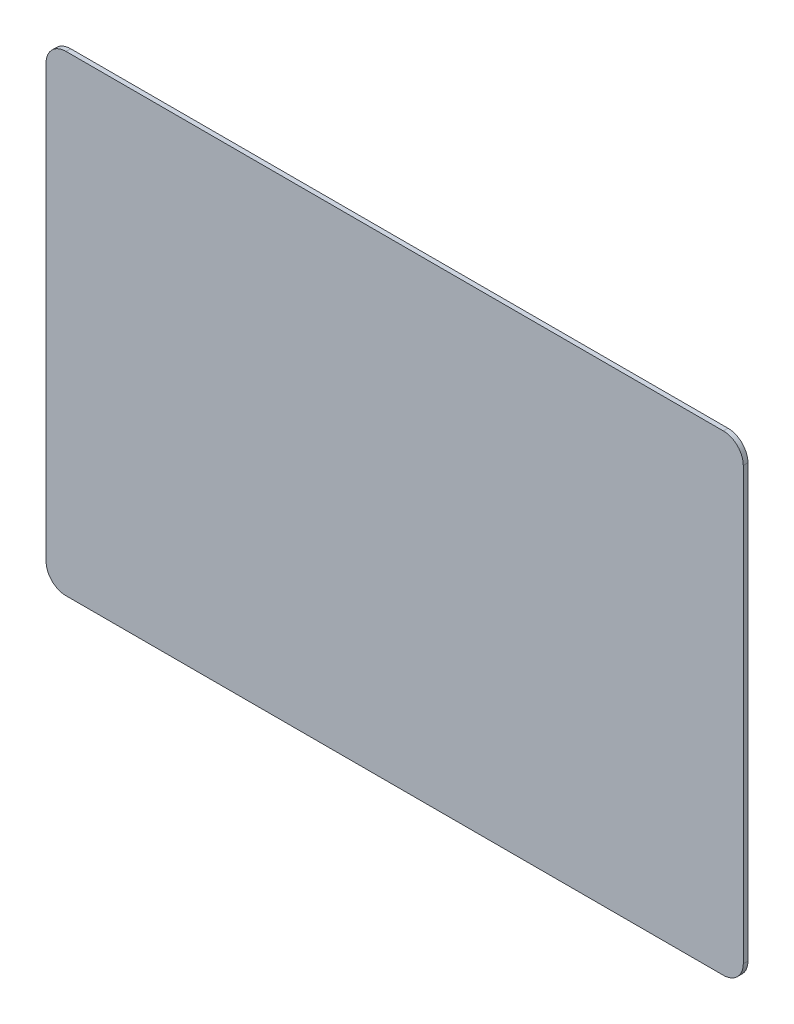
ISO-10303-21;
HEADER;
FILE_DESCRIPTION(('STEP AP214'),'2;1');
FILE_NAME('part.step','',(''),(''),'','','');
FILE_SCHEMA(('AUTOMOTIVE_DESIGN { 1 0 10303 214 1 1 1 1 }'));
ENDSEC;
DATA;
#1=APPLICATION_CONTEXT('core data for automotive mechanical design processes');
#2=APPLICATION_PROTOCOL_DEFINITION('international standard','automotive_design',2000,#1);
#3=PRODUCT_CONTEXT('',#1,'mechanical');
#4=PRODUCT('Part','Part','',(#3));
#5=PRODUCT_RELATED_PRODUCT_CATEGORY('part','',(#4));
#6=PRODUCT_DEFINITION_FORMATION('','',#4);
#7=PRODUCT_DEFINITION_CONTEXT('part definition',#1,'design');
#8=PRODUCT_DEFINITION('design','',#6,#7);
#9=PRODUCT_DEFINITION_SHAPE('','',#8);
#10=(LENGTH_UNIT() NAMED_UNIT(*) SI_UNIT(.MILLI.,.METRE.));
#11=(NAMED_UNIT(*) PLANE_ANGLE_UNIT() SI_UNIT($,.RADIAN.));
#12=(NAMED_UNIT(*) SI_UNIT($,.STERADIAN.) SOLID_ANGLE_UNIT());
#13=UNCERTAINTY_MEASURE_WITH_UNIT(LENGTH_MEASURE(1.E-05),#10,'distance_accuracy_value','');
#14=(GEOMETRIC_REPRESENTATION_CONTEXT(3) GLOBAL_UNCERTAINTY_ASSIGNED_CONTEXT((#13)) GLOBAL_UNIT_ASSIGNED_CONTEXT((#10,
#11,#12)) REPRESENTATION_CONTEXT('',''));
#15=CARTESIAN_POINT('',(0.,0.,0.));
#16=DIRECTION('',(0.,0.,1.));
#17=DIRECTION('',(1.,0.,0.));
#18=AXIS2_PLACEMENT_3D('',#15,#16,#17);
#19=CARTESIAN_POINT('',(49.5,-272.091788976976,0.701000000000714));
#20=DIRECTION('',(0.,0.,-1.));
#21=DIRECTION('',(-1.,0.,0.));
#22=AXIS2_PLACEMENT_3D('',#19,#20,#21);
#23=CYLINDRICAL_SURFACE('',#22,2.99999999999999);
#24=CARTESIAN_POINT('',(49.5,-275.091788976976,0.70000000000033));
#25=CARTESIAN_POINT('',(49.5843798635019,-275.0917970621,0.70000000000033));
#26=CARTESIAN_POINT('',(49.668755894761,-275.088229025354,0.70000000000033));
#27=CARTESIAN_POINT('',(49.8369042606306,-275.074003276228,0.700000000000331));
#28=CARTESIAN_POINT('',(49.9206766240054,-275.063345903938,0.700000000000331));
#29=CARTESIAN_POINT('',(50.0869669809482,-275.035014748458,0.700000000000331));
#30=CARTESIAN_POINT('',(50.1694858745097,-275.017346273078,0.700000000000332));
#31=CARTESIAN_POINT('',(50.3327218152186,-274.975136229641,0.700000000000332));
#32=CARTESIAN_POINT('',(50.4134388843482,-274.950594745483,0.700000000000332));
#33=CARTESIAN_POINT('',(50.6521085428877,-274.866859032351,0.700000000000333));
#34=CARTESIAN_POINT('',(50.8066472549077,-274.797541951899,0.700000000000333));
#35=CARTESIAN_POINT('',(51.1017802103869,-274.633992715414,0.700000000000334));
#36=CARTESIAN_POINT('',(51.242376904348,-274.53976494849,0.700000000000335));
#37=CARTESIAN_POINT('',(51.5057786852385,-274.32903761871,0.700000000000336));
#38=CARTESIAN_POINT('',(51.6285839457793,-274.212538273208,0.700000000000336));
#39=CARTESIAN_POINT('',(51.8529112926632,-273.960550982874,0.700000000000337));
#40=CARTESIAN_POINT('',(51.9544292107432,-273.825059327819,0.700000000000337));
#41=CARTESIAN_POINT('',(52.1332922306062,-273.538941638879,0.700000000000337));
#42=CARTESIAN_POINT('',(52.2106325999279,-273.38831264966,0.700000000000338));
#43=CARTESIAN_POINT('',(52.338886608652,-273.076238034081,0.700000000000338));
#44=CARTESIAN_POINT('',(52.3898157261376,-272.914798805749,0.700000000000338));
#45=CARTESIAN_POINT('',(52.4511453910628,-272.642274531183,0.700000000000338));
#46=CARTESIAN_POINT('',(52.4694548018945,-272.532903868641,0.700000000000339));
#47=CARTESIAN_POINT('',(52.493880504202,-272.312967077816,0.700000000000339));
#48=CARTESIAN_POINT('',(52.500014081586,-272.202402868695,0.700000000000339));
#49=CARTESIAN_POINT('',(52.4999999999999,-272.091788976976,0.700000000000339));
#50=B_SPLINE_CURVE_WITH_KNOTS('',3,(#24,#25,#26,#27,#28,#29,#30,#31,#32,#33,#34,#35,#36,#37,#38,
#39,#40,#41,#42,#43,#44,#45,#46,#47,#48,#49),.UNSPECIFIED.,.F.,.F.,(4,2,2,2,2,2,2,2,2,2,2,2,4),
(0.,0.253057267660258,0.506102396572864,0.758956320118635,1.01180715716301,1.51730545512211,
2.0227147467139,2.52811910611892,3.03362233625821,3.53922445064271,4.04452992552588,
4.37657668424449,4.70815170142137),.UNSPECIFIED.);
#51=CARTESIAN_POINT('',(49.5,-275.091788976976,0.70000000000033));
#52=VERTEX_POINT('',#51);
#53=CARTESIAN_POINT('',(52.5,-272.091788976976,0.699997500000526));
#54=VERTEX_POINT('',#53);
#55=EDGE_CURVE('E184',#52,#54,#50,.T.);
#56=ORIENTED_EDGE('',*,*,#55,.F.);
#57=DIRECTION('',(0.,0.,-1.));
#58=VECTOR('',#57,1.);
#59=CARTESIAN_POINT('',(49.5,-275.091788976976,0.701000000000714));
#60=LINE('',#59,#58);
#61=CARTESIAN_POINT('',(49.5,-275.091788976976,0.));
#62=VERTEX_POINT('',#61);
#63=EDGE_CURVE('E45',#52,#62,#60,.T.);
#64=ORIENTED_EDGE('',*,*,#63,.T.);
#65=CARTESIAN_POINT('',(49.5,-272.091788976976,0.));
#66=DIRECTION('',(0.,0.,1.));
#67=DIRECTION('',(1.,0.,0.));
#68=AXIS2_PLACEMENT_3D('',#65,#66,#67);
#69=CIRCLE('',#68,2.99999999999999);
#70=CARTESIAN_POINT('',(52.5,-272.091788976976,0.));
#71=VERTEX_POINT('',#70);
#72=EDGE_CURVE('E221',#62,#71,#69,.T.);
#73=ORIENTED_EDGE('',*,*,#72,.T.);
#74=DIRECTION('',(0.,0.,-1.));
#75=VECTOR('',#74,1.);
#76=CARTESIAN_POINT('',(52.5,-272.091788976976,0.701000000000714));
#77=LINE('',#76,#75);
#78=EDGE_CURVE('E96',#54,#71,#77,.T.);
#79=ORIENTED_EDGE('',*,*,#78,.F.);
#80=EDGE_LOOP('',(#56,#64,#73,#79));
#81=FACE_BOUND('',#80,.T.);
#82=ADVANCED_FACE('F38',(#81),#23,.T.);
#83=CARTESIAN_POINT('',(52.5,-272.091788976976,0.701000000000714));
#84=DIRECTION('',(-1.,0.,0.));
#85=DIRECTION('',(0.,-1.,0.));
#86=AXIS2_PLACEMENT_3D('',#83,#84,#85);
#87=PLANE('',#86);
#88=CARTESIAN_POINT('',(52.5,-272.091788976976,0.700000000000339));
#89=CARTESIAN_POINT('',(52.4999999999999,-264.295802660997,0.70000000000034));
#90=CARTESIAN_POINT('',(52.4999999999999,-256.499816345018,0.700000000000342));
#91=CARTESIAN_POINT('',(52.4999999999999,-234.833149678351,0.700000000000346));
#92=CARTESIAN_POINT('',(52.5,-220.962469327664,0.700000000000347));
#93=CARTESIAN_POINT('',(52.5,-207.091788976976,0.700000000000349));
#94=B_SPLINE_CURVE_WITH_KNOTS('',3,(#88,#89,#90,#91,#92,#93),.UNSPECIFIED.,.F.,.F.,(4,2,4),(0.,
23.3879589479382,64.9999999999999),.UNSPECIFIED.);
#95=CARTESIAN_POINT('',(52.5,-207.091788976976,0.700000000000349));
#96=VERTEX_POINT('',#95);
#97=EDGE_CURVE('E103',#54,#96,#94,.T.);
#98=ORIENTED_EDGE('',*,*,#97,.F.);
#99=ORIENTED_EDGE('',*,*,#78,.T.);
#100=DIRECTION('',(0.,1.,0.));
#101=VECTOR('',#100,1.);
#102=CARTESIAN_POINT('',(52.5,-272.091788976976,0.));
#103=LINE('',#102,#101);
#104=CARTESIAN_POINT('',(52.5,-207.091788976976,0.));
#105=VERTEX_POINT('',#104);
#106=EDGE_CURVE('E223',#71,#105,#103,.T.);
#107=ORIENTED_EDGE('',*,*,#106,.T.);
#108=DIRECTION('',(0.,0.,-1.));
#109=VECTOR('',#108,1.);
#110=CARTESIAN_POINT('',(52.5,-207.091788976976,0.701000000000714));
#111=LINE('',#110,#109);
#112=EDGE_CURVE('E226',#96,#105,#111,.T.);
#113=ORIENTED_EDGE('',*,*,#112,.F.);
#114=EDGE_LOOP('',(#98,#99,#107,#113));
#115=FACE_BOUND('',#114,.T.);
#116=ADVANCED_FACE('F190',(#115),#87,.F.);
#117=CARTESIAN_POINT('',(49.5,-207.091788976976,0.701000000000714));
#118=DIRECTION('',(0.,0.,-1.));
#119=DIRECTION('',(-1.,0.,0.));
#120=AXIS2_PLACEMENT_3D('',#117,#118,#119);
#121=CYLINDRICAL_SURFACE('',#120,3.);
#122=CARTESIAN_POINT('',(52.5,-207.091788976976,0.700000000000349));
#123=CARTESIAN_POINT('',(52.5000080851237,-207.007409113474,0.700000000000349));
#124=CARTESIAN_POINT('',(52.4964400483774,-206.923033082215,0.700000000000349));
#125=CARTESIAN_POINT('',(52.482214299252,-206.754884716346,0.700000000000349));
#126=CARTESIAN_POINT('',(52.4715569269616,-206.671112352971,0.700000000000349));
#127=CARTESIAN_POINT('',(52.443225771482,-206.504821996028,0.700000000000349));
#128=CARTESIAN_POINT('',(52.4255572961018,-206.422303102467,0.700000000000349));
#129=CARTESIAN_POINT('',(52.3833472526641,-206.259067161758,0.700000000000349));
#130=CARTESIAN_POINT('',(52.3588057685067,-206.178350092628,0.700000000000349));
#131=CARTESIAN_POINT('',(52.2750700553752,-205.939680434089,0.700000000000349));
#132=CARTESIAN_POINT('',(52.2057529749222,-205.785141722069,0.700000000000348));
#133=CARTESIAN_POINT('',(52.0422037384376,-205.49000876659,0.700000000000348));
#134=CARTESIAN_POINT('',(51.9479759715141,-205.349412072628,0.700000000000348));
#135=CARTESIAN_POINT('',(51.7372486417336,-205.086010291738,0.700000000000348));
#136=CARTESIAN_POINT('',(51.6207492962314,-204.963205031197,0.700000000000348));
#137=CARTESIAN_POINT('',(51.368762005898,-204.738877684313,0.700000000000347));
#138=CARTESIAN_POINT('',(51.2332703508427,-204.637359766233,0.700000000000347));
#139=CARTESIAN_POINT('',(50.9471526619026,-204.45849674637,0.700000000000347));
#140=CARTESIAN_POINT('',(50.7965236726841,-204.381156377049,0.700000000000347));
#141=CARTESIAN_POINT('',(50.4844490571044,-204.252902368324,0.700000000000347));
#142=CARTESIAN_POINT('',(50.3230098287728,-204.201973250839,0.700000000000346));
#143=CARTESIAN_POINT('',(50.0504855542061,-204.140643585914,0.700000000000346));
#144=CARTESIAN_POINT('',(49.9411148916651,-204.122334175082,0.700000000000346));
#145=CARTESIAN_POINT('',(49.7211781008399,-204.097908472774,0.700000000000346));
#146=CARTESIAN_POINT('',(49.6106138917187,-204.09177489539,0.700000000000346));
#147=CARTESIAN_POINT('',(49.4999999999999,-204.091788976976,0.700000000000346));
#148=B_SPLINE_CURVE_WITH_KNOTS('',3,(#122,#123,#124,#125,#126,#127,#128,#129,#130,#131,#132,
#133,#134,#135,#136,#137,#138,#139,#140,#141,#142,#143,#144,#145,#146,#147),.UNSPECIFIED.,.F.,
.F.,(4,2,2,2,2,2,2,2,2,2,2,2,4),(0.,0.253057267660222,0.506102396572833,0.758956320118641,
1.01180715716298,1.51730545512208,2.02271474671388,2.52811910611888,3.03362233625813,
3.53922445064267,4.04452992552591,4.37657668424453,4.70815170142148),.UNSPECIFIED.);
#149=CARTESIAN_POINT('',(49.5,-204.091788976976,0.699997500000395));
#150=VERTEX_POINT('',#149);
#151=EDGE_CURVE('E172',#96,#150,#148,.T.);
#152=ORIENTED_EDGE('',*,*,#151,.F.);
#153=ORIENTED_EDGE('',*,*,#112,.T.);
#154=CARTESIAN_POINT('',(49.5,-207.091788976976,0.));
#155=DIRECTION('',(0.,0.,1.));
#156=DIRECTION('',(1.,0.,0.));
#157=AXIS2_PLACEMENT_3D('',#154,#155,#156);
#158=CIRCLE('',#157,3.);
#159=CARTESIAN_POINT('',(49.5,-204.091788976976,0.));
#160=VERTEX_POINT('',#159);
#161=EDGE_CURVE('E227',#105,#160,#158,.T.);
#162=ORIENTED_EDGE('',*,*,#161,.T.);
#163=DIRECTION('',(0.,0.,-1.));
#164=VECTOR('',#163,1.);
#165=CARTESIAN_POINT('',(49.5,-204.091788976976,0.701000000000714));
#166=LINE('',#165,#164);
#167=EDGE_CURVE('E230',#150,#160,#166,.T.);
#168=ORIENTED_EDGE('',*,*,#167,.F.);
#169=EDGE_LOOP('',(#152,#153,#162,#168));
#170=FACE_BOUND('',#169,.T.);
#171=ADVANCED_FACE('F163',(#170),#121,.T.);
#172=CARTESIAN_POINT('',(49.5,-204.091788976976,0.701000000000714));
#173=DIRECTION('',(0.,-1.,0.));
#174=DIRECTION('',(1.,0.,0.));
#175=AXIS2_PLACEMENT_3D('',#172,#173,#174);
#176=PLANE('',#175);
#177=CARTESIAN_POINT('',(49.5,-204.091788976976,0.700000000000346));
#178=CARTESIAN_POINT('',(16.5,-204.091788976976,0.700000000000256));
#179=CARTESIAN_POINT('',(-16.5,-204.091788976976,0.700000000000166));
#180=CARTESIAN_POINT('',(-49.5,-204.091788976976,0.700000000000076));
#181=B_SPLINE_CURVE_WITH_KNOTS('',3,(#177,#178,#179,#180),.UNSPECIFIED.,.F.,.F.,(4,4),(0.,
98.9999999999999),.UNSPECIFIED.);
#182=CARTESIAN_POINT('',(-49.5,-204.091788976976,0.700000000000076));
#183=VERTEX_POINT('',#182);
#184=EDGE_CURVE('E131',#150,#183,#181,.T.);
#185=ORIENTED_EDGE('',*,*,#184,.F.);
#186=ORIENTED_EDGE('',*,*,#167,.T.);
#187=DIRECTION('',(-1.,0.,0.));
#188=VECTOR('',#187,1.);
#189=CARTESIAN_POINT('',(49.5,-204.091788976976,0.));
#190=LINE('',#189,#188);
#191=CARTESIAN_POINT('',(-49.5,-204.091788976976,0.));
#192=VERTEX_POINT('',#191);
#193=EDGE_CURVE('E231',#160,#192,#190,.T.);
#194=ORIENTED_EDGE('',*,*,#193,.T.);
#195=DIRECTION('',(0.,0.,-1.));
#196=VECTOR('',#195,1.);
#197=CARTESIAN_POINT('',(-49.5,-204.091788976976,0.701000000000714));
#198=LINE('',#197,#196);
#199=EDGE_CURVE('E234',#183,#192,#198,.T.);
#200=ORIENTED_EDGE('',*,*,#199,.F.);
#201=EDGE_LOOP('',(#185,#186,#194,#200));
#202=FACE_BOUND('',#201,.T.);
#203=ADVANCED_FACE('F158',(#202),#176,.F.);
#204=CARTESIAN_POINT('',(-49.5,-207.091788976976,0.701000000000714));
#205=DIRECTION('',(0.,0.,-1.));
#206=DIRECTION('',(-1.,0.,0.));
#207=AXIS2_PLACEMENT_3D('',#204,#205,#206);
#208=CYLINDRICAL_SURFACE('',#207,3.);
#209=CARTESIAN_POINT('',(-49.5,-204.091788976976,0.700000000000076));
#210=CARTESIAN_POINT('',(-49.584379863502,-204.091780891853,0.700000000000076));
#211=CARTESIAN_POINT('',(-49.6687558947611,-204.095348928599,0.700000000000076));
#212=CARTESIAN_POINT('',(-49.8369042606307,-204.109574677724,0.700000000000075));
#213=CARTESIAN_POINT('',(-49.9206766240055,-204.120232050015,0.700000000000075));
#214=CARTESIAN_POINT('',(-50.0869669809483,-204.148563205494,0.700000000000074));
#215=CARTESIAN_POINT('',(-50.1694858745098,-204.166231680875,0.700000000000074));
#216=CARTESIAN_POINT('',(-50.3327218152187,-204.208441724312,0.700000000000073));
#217=CARTESIAN_POINT('',(-50.4134388843483,-204.23298320847,0.700000000000073));
#218=CARTESIAN_POINT('',(-50.6521085428878,-204.316718921601,0.700000000000072));
#219=CARTESIAN_POINT('',(-50.8066472549078,-204.386036002054,0.700000000000072));
#220=CARTESIAN_POINT('',(-51.1017802103869,-204.549585238539,0.700000000000071));
#221=CARTESIAN_POINT('',(-51.2423769043481,-204.643813005462,0.70000000000007));
#222=CARTESIAN_POINT('',(-51.5057786852387,-204.854540335243,0.70000000000007));
#223=CARTESIAN_POINT('',(-51.6285839457794,-204.971039680745,0.700000000000069));
#224=CARTESIAN_POINT('',(-51.8529112926632,-205.223026971078,0.700000000000069));
#225=CARTESIAN_POINT('',(-51.9544292107433,-205.358518626134,0.700000000000069));
#226=CARTESIAN_POINT('',(-52.1332922306062,-205.644636315074,0.700000000000068));
#227=CARTESIAN_POINT('',(-52.210632599928,-205.795265304292,0.700000000000068));
#228=CARTESIAN_POINT('',(-52.338886608652,-206.107339919872,0.700000000000068));
#229=CARTESIAN_POINT('',(-52.3898157261376,-206.268779148204,0.700000000000068));
#230=CARTESIAN_POINT('',(-52.4511453910628,-206.54130342277,0.700000000000068));
#231=CARTESIAN_POINT('',(-52.4694548018946,-206.650674085311,0.700000000000068));
#232=CARTESIAN_POINT('',(-52.4938805042021,-206.870610876137,0.700000000000068));
#233=CARTESIAN_POINT('',(-52.5000140815861,-206.981175085258,0.700000000000068));
#234=CARTESIAN_POINT('',(-52.5,-207.091788976976,0.700000000000068));
#235=B_SPLINE_CURVE_WITH_KNOTS('',3,(#209,#210,#211,#212,#213,#214,#215,#216,#217,#218,#219,
#220,#221,#222,#223,#224,#225,#226,#227,#228,#229,#230,#231,#232,#233,#234),.UNSPECIFIED.,.F.,
.F.,(4,2,2,2,2,2,2,2,2,2,2,2,4),(0.,0.253057267660284,0.506102396572889,0.758956320118698,
1.01180715716307,1.51730545512215,2.02271474671397,2.528119106119,3.03362233625832,
3.53922445064281,4.04452992552598,4.37657668424457,4.70815170142148),.UNSPECIFIED.);
#236=CARTESIAN_POINT('',(-52.5,-207.091788976976,0.699997500000391));
#237=VERTEX_POINT('',#236);
#238=EDGE_CURVE('E129',#183,#237,#235,.T.);
#239=ORIENTED_EDGE('',*,*,#238,.F.);
#240=ORIENTED_EDGE('',*,*,#199,.T.);
#241=CARTESIAN_POINT('',(-49.5,-207.091788976976,0.));
#242=DIRECTION('',(0.,0.,1.));
#243=DIRECTION('',(1.,0.,0.));
#244=AXIS2_PLACEMENT_3D('',#241,#242,#243);
#245=CIRCLE('',#244,3.);
#246=CARTESIAN_POINT('',(-52.5,-207.091788976976,0.));
#247=VERTEX_POINT('',#246);
#248=EDGE_CURVE('E235',#192,#247,#245,.T.);
#249=ORIENTED_EDGE('',*,*,#248,.T.);
#250=DIRECTION('',(0.,0.,-1.));
#251=VECTOR('',#250,1.);
#252=CARTESIAN_POINT('',(-52.5,-207.091788976976,0.701000000000714));
#253=LINE('',#252,#251);
#254=EDGE_CURVE('E238',#237,#247,#253,.T.);
#255=ORIENTED_EDGE('',*,*,#254,.F.);
#256=EDGE_LOOP('',(#239,#240,#249,#255));
#257=FACE_BOUND('',#256,.T.);
#258=ADVANCED_FACE('F152',(#257),#208,.T.);
#259=CARTESIAN_POINT('',(-52.5,-207.091788976976,0.701000000000714));
#260=DIRECTION('',(1.,0.,0.));
#261=DIRECTION('',(0.,1.,0.));
#262=AXIS2_PLACEMENT_3D('',#259,#260,#261);
#263=PLANE('',#262);
#264=CARTESIAN_POINT('',(-52.5,-207.091788976976,0.700000000000068));
#265=CARTESIAN_POINT('',(-52.5,-214.887775292956,0.700000000000076));
#266=CARTESIAN_POINT('',(-52.5,-222.683761608935,0.700000000000083));
#267=CARTESIAN_POINT('',(-52.5,-244.350428275602,0.700000000000103));
#268=CARTESIAN_POINT('',(-52.5,-258.221108626289,0.700000000000114));
#269=CARTESIAN_POINT('',(-52.5,-272.091788976976,0.700000000000124));
#270=B_SPLINE_CURVE_WITH_KNOTS('',3,(#264,#265,#266,#267,#268,#269),.UNSPECIFIED.,.F.,.F.,(4,2,
4),(0.,23.3879589479382,65.),.UNSPECIFIED.);
#271=CARTESIAN_POINT('',(-52.5,-272.091788976976,0.700000000000124));
#272=VERTEX_POINT('',#271);
#273=EDGE_CURVE('E50',#237,#272,#270,.T.);
#274=ORIENTED_EDGE('',*,*,#273,.F.);
#275=ORIENTED_EDGE('',*,*,#254,.T.);
#276=DIRECTION('',(0.,-1.,0.));
#277=VECTOR('',#276,1.);
#278=CARTESIAN_POINT('',(-52.5,-207.091788976976,0.));
#279=LINE('',#278,#277);
#280=CARTESIAN_POINT('',(-52.5,-272.091788976976,0.));
#281=VERTEX_POINT('',#280);
#282=EDGE_CURVE('E123',#247,#281,#279,.T.);
#283=ORIENTED_EDGE('',*,*,#282,.T.);
#284=DIRECTION('',(0.,0.,-1.));
#285=VECTOR('',#284,1.);
#286=CARTESIAN_POINT('',(-52.5,-272.091788976976,0.701000000000714));
#287=LINE('',#286,#285);
#288=EDGE_CURVE('E114',#272,#281,#287,.T.);
#289=ORIENTED_EDGE('',*,*,#288,.F.);
#290=EDGE_LOOP('',(#274,#275,#283,#289));
#291=FACE_BOUND('',#290,.T.);
#292=ADVANCED_FACE('F120',(#291),#263,.F.);
#293=CARTESIAN_POINT('',(-49.5,-272.091788976976,0.701000000000714));
#294=DIRECTION('',(0.,0.,-1.));
#295=DIRECTION('',(-1.,0.,0.));
#296=AXIS2_PLACEMENT_3D('',#293,#294,#295);
#297=CYLINDRICAL_SURFACE('',#296,3.);
#298=CARTESIAN_POINT('',(-52.5,-272.091788976976,0.700000000000124));
#299=CARTESIAN_POINT('',(-52.5000080851238,-272.176168840478,0.700000000000125));
#300=CARTESIAN_POINT('',(-52.4964400483774,-272.260544871737,0.700000000000125));
#301=CARTESIAN_POINT('',(-52.482214299252,-272.428693237607,0.700000000000125));
#302=CARTESIAN_POINT('',(-52.4715569269616,-272.512465600982,0.700000000000125));
#303=CARTESIAN_POINT('',(-52.443225771482,-272.678755957925,0.700000000000125));
#304=CARTESIAN_POINT('',(-52.4255572961018,-272.761274851486,0.700000000000125));
#305=CARTESIAN_POINT('',(-52.3833472526641,-272.924510792195,0.700000000000125));
#306=CARTESIAN_POINT('',(-52.3588057685066,-273.005227861325,0.700000000000125));
#307=CARTESIAN_POINT('',(-52.2750700553751,-273.243897519864,0.700000000000126));
#308=CARTESIAN_POINT('',(-52.2057529749221,-273.398436231884,0.700000000000126));
#309=CARTESIAN_POINT('',(-52.0422037384375,-273.693569187363,0.700000000000126));
#310=CARTESIAN_POINT('',(-51.947975971514,-273.834165881325,0.700000000000127));
#311=CARTESIAN_POINT('',(-51.7372486417334,-274.097567662215,0.700000000000127));
#312=CARTESIAN_POINT('',(-51.6207492962312,-274.220372922756,0.700000000000127));
#313=CARTESIAN_POINT('',(-51.3687620058978,-274.44470026964,0.700000000000128));
#314=CARTESIAN_POINT('',(-51.2332703508425,-274.54621818772,0.700000000000128));
#315=CARTESIAN_POINT('',(-50.9471526619024,-274.725081207583,0.700000000000128));
#316=CARTESIAN_POINT('',(-50.7965236726839,-274.802421576904,0.700000000000129));
#317=CARTESIAN_POINT('',(-50.4844490571041,-274.930675585628,0.700000000000129));
#318=CARTESIAN_POINT('',(-50.3230098287726,-274.981604703114,0.700000000000129));
#319=CARTESIAN_POINT('',(-50.0504855542059,-275.042934368039,0.70000000000013));
#320=CARTESIAN_POINT('',(-49.941114891665,-275.061243778871,0.70000000000013));
#321=CARTESIAN_POINT('',(-49.7211781008399,-275.085669481178,0.70000000000013));
#322=CARTESIAN_POINT('',(-49.6106138917187,-275.091803058563,0.70000000000013));
#323=CARTESIAN_POINT('',(-49.5,-275.091788976976,0.700000000000131));
#324=B_SPLINE_CURVE_WITH_KNOTS('',3,(#298,#299,#300,#301,#302,#303,#304,#305,#306,#307,#308,
#309,#310,#311,#312,#313,#314,#315,#316,#317,#318,#319,#320,#321,#322,#323),.UNSPECIFIED.,.F.,
.F.,(4,2,2,2,2,2,2,2,2,2,2,2,4),(0.,0.253057267660278,0.506102396572891,0.758956320118759,
1.01180715716314,1.51730545512224,2.02271474671415,2.52811910611912,3.03362233625837,
3.5392244506429,4.04452992552612,4.37657668424462,4.70815170142145),.UNSPECIFIED.);
#325=CARTESIAN_POINT('',(-49.5,-275.091788976976,0.699997500000422));
#326=VERTEX_POINT('',#325);
#327=EDGE_CURVE('E11',#272,#326,#324,.T.);
#328=ORIENTED_EDGE('',*,*,#327,.F.);
#329=ORIENTED_EDGE('',*,*,#288,.T.);
#330=CARTESIAN_POINT('',(-49.5,-272.091788976976,0.));
#331=DIRECTION('',(0.,0.,1.));
#332=DIRECTION('',(1.,0.,0.));
#333=AXIS2_PLACEMENT_3D('',#330,#331,#332);
#334=CIRCLE('',#333,3.);
#335=CARTESIAN_POINT('',(-49.5,-275.091788976976,0.));
#336=VERTEX_POINT('',#335);
#337=EDGE_CURVE('E125',#281,#336,#334,.T.);
#338=ORIENTED_EDGE('',*,*,#337,.T.);
#339=DIRECTION('',(0.,0.,-1.));
#340=VECTOR('',#339,1.);
#341=CARTESIAN_POINT('',(-49.5,-275.091788976976,0.701000000000714));
#342=LINE('',#341,#340);
#343=EDGE_CURVE('E63',#326,#336,#342,.T.);
#344=ORIENTED_EDGE('',*,*,#343,.F.);
#345=EDGE_LOOP('',(#328,#329,#338,#344));
#346=FACE_BOUND('',#345,.T.);
#347=ADVANCED_FACE('F113',(#346),#297,.T.);
#348=CARTESIAN_POINT('',(-49.5,-275.091788976976,0.701000000000714));
#349=DIRECTION('',(0.,1.,0.));
#350=DIRECTION('',(0.,0.,1.));
#351=AXIS2_PLACEMENT_3D('',#348,#349,#350);
#352=PLANE('',#351);
#353=CARTESIAN_POINT('',(-49.5,-275.091788976976,0.700000000000131));
#354=CARTESIAN_POINT('',(-16.5,-275.091788976976,0.700000000000197));
#355=CARTESIAN_POINT('',(16.5,-275.091788976976,0.700000000000263));
#356=CARTESIAN_POINT('',(49.4999999999999,-275.091788976976,0.70000000000033));
#357=B_SPLINE_CURVE_WITH_KNOTS('',3,(#353,#354,#355,#356),.UNSPECIFIED.,.F.,.F.,(4,4),(0.,
98.9999999999999),.UNSPECIFIED.);
#358=EDGE_CURVE('E200',#326,#52,#357,.T.);
#359=ORIENTED_EDGE('',*,*,#358,.F.);
#360=ORIENTED_EDGE('',*,*,#343,.T.);
#361=DIRECTION('',(1.,0.,0.));
#362=VECTOR('',#361,1.);
#363=CARTESIAN_POINT('',(-49.5,-275.091788976976,0.));
#364=LINE('',#363,#362);
#365=EDGE_CURVE('E201',#336,#62,#364,.T.);
#366=ORIENTED_EDGE('',*,*,#365,.T.);
#367=ORIENTED_EDGE('',*,*,#63,.F.);
#368=EDGE_LOOP('',(#359,#360,#366,#367));
#369=FACE_BOUND('',#368,.T.);
#370=ADVANCED_FACE('F209',(#369),#352,.F.);
#371=CARTESIAN_POINT('',(49.5,-272.091788976976,0.));
#372=DIRECTION('',(0.,0.,1.));
#373=DIRECTION('',(1.,0.,0.));
#374=AXIS2_PLACEMENT_3D('',#371,#372,#373);
#375=PLANE('',#374);
#376=ORIENTED_EDGE('',*,*,#72,.F.);
#377=ORIENTED_EDGE('',*,*,#365,.F.);
#378=ORIENTED_EDGE('',*,*,#337,.F.);
#379=ORIENTED_EDGE('',*,*,#282,.F.);
#380=ORIENTED_EDGE('',*,*,#248,.F.);
#381=ORIENTED_EDGE('',*,*,#193,.F.);
#382=ORIENTED_EDGE('',*,*,#161,.F.);
#383=ORIENTED_EDGE('',*,*,#106,.F.);
#384=EDGE_LOOP('',(#376,#377,#378,#379,#380,#381,#382,#383));
#385=FACE_BOUND('',#384,.T.);
#386=ADVANCED_FACE('F213',(#385),#375,.F.);
#387=CARTESIAN_POINT('',(-155.159999998209,-59.5747718603923,-2.99855643418435));
#388=CARTESIAN_POINT('',(-154.999999998211,-59.6747586728657,-2.96193706354887));
#389=CARTESIAN_POINT('',(-138.999999998392,-69.6734399202081,0.699999999999965));
#390=CARTESIAN_POINT('',(-155.438105935242,-59.5747718603923,-2.99855643418435));
#391=CARTESIAN_POINT('',(-155.277824845527,-59.6747586728657,-2.96193706354887));
#392=CARTESIAN_POINT('',(-139.249715873979,-69.6734399202081,0.699999999999965));
#393=CARTESIAN_POINT('',(-155.965902555591,-59.630396259121,-2.99764537690038));
#394=CARTESIAN_POINT('',(-155.805599861272,-59.7302959625128,-2.96103502663402));
#395=CARTESIAN_POINT('',(-139.775330429344,-69.7202663016974,0.700000000000131));
#396=CARTESIAN_POINT('',(-156.680126516036,-59.8523076016594,-2.99400027186741));
#397=CARTESIAN_POINT('',(-156.520911422723,-59.9524985150472,-2.95742601174992));
#398=CARTESIAN_POINT('',(-140.599402091411,-69.9715898538324,0.699999999999854));
#399=CARTESIAN_POINT('',(-157.32499829554,-60.1845649252973,-2.98853130047265));
#400=CARTESIAN_POINT('',(-157.167145085766,-60.285882434768,-2.95201118858679));
#401=CARTESIAN_POINT('',(-141.381824108338,-70.4176333818381,0.700000000000048));
#402=CARTESIAN_POINT('',(-157.895069136755,-60.6263657212818,-2.98125741944953));
#403=CARTESIAN_POINT('',(-157.738050231379,-60.7292921350528,-2.94480932618765));
#404=CARTESIAN_POINT('',(-142.036159693766,-71.0219335121532,0.699999999999923));
#405=CARTESIAN_POINT('',(-158.386319314434,-61.1707084413876,-2.97230488942808));
#406=CARTESIAN_POINT('',(-158.229170307608,-61.2750308735698,-2.93594543507732));
#407=CARTESIAN_POINT('',(-142.514269625038,-71.7072740917972,0.699999999999826));
#408=CARTESIAN_POINT('',(-158.786062229605,-61.8240779833641,-2.96157923929062));
#409=CARTESIAN_POINT('',(-158.627945230413,-61.9288575305824,-2.92532597949567));
#410=CARTESIAN_POINT('',(-142.816245311141,-72.4068122524087,0.700000000000076));
#411=CARTESIAN_POINT('',(-159.07142011255,-62.6007753195237,-2.94885634689289));
#412=CARTESIAN_POINT('',(-158.912022896496,-62.7044344044587,-2.9127290563296));
#413=CARTESIAN_POINT('',(-142.972301291058,-73.0703428979637,0.70000000000002));
#414=CARTESIAN_POINT('',(-159.16,-63.2209390847193,-2.93871719221465));
#415=CARTESIAN_POINT('',(-159.,-63.3225087890663,-2.90269028932146));
#416=CARTESIAN_POINT('',(-143.,-73.479479223757,0.699999999999951));
#417=CARTESIAN_POINT('',(-159.16,-81.429238634156,-2.6413543065948));
#418=CARTESIAN_POINT('',(-159.,-81.4495014592341,-2.60827159068794));
#419=CARTESIAN_POINT('',(-143.,-83.4757839670469,0.699999999999951));
#420=CARTESIAN_POINT('',(-159.16,-117.356393054956,-2.05466833972508));
#421=CARTESIAN_POINT('',(-159.,-117.213387053002,-2.02739439576741));
#422=CARTESIAN_POINT('',(-143.,-102.912786857649,0.699999999999895));
#423=CARTESIAN_POINT('',(-159.16,-171.624841708436,-1.1685481999951));
#424=CARTESIAN_POINT('',(-159.,-171.230529253812,-1.15004772276743));
#425=CARTESIAN_POINT('',(-143.,-131.799283791396,0.700000000000048));
#426=CARTESIAN_POINT('',(-159.16,-225.977031554111,-0.281077112591746));
#427=CARTESIAN_POINT('',(-159.,-225.330024094327,-0.271363477813633));
#428=CARTESIAN_POINT('',(-143.,-160.629278115909,0.699999999999826));
#429=CARTESIAN_POINT('',(-159.16,-262.068741361516,0.308262782971136));
#430=CARTESIAN_POINT('',(-159.,-261.255690960372,0.312141369278332));
#431=CARTESIAN_POINT('',(-143.,-179.950650846067,0.699999999999937));
#432=CARTESIAN_POINT('',(-159.16,-280.894723421094,0.615689573877393));
#433=CARTESIAN_POINT('',(-159.,-279.996170875195,0.616524330571688));
#434=CARTESIAN_POINT('',(-143.,-190.140916285291,0.699999999999951));
#435=CARTESIAN_POINT('',(-158.778601735109,-282.615257788349,0.643789595491523));
#436=CARTESIAN_POINT('',(-158.620745579541,-281.709124678324,0.644346134150015));
#437=CARTESIAN_POINT('',(-142.835130022774,-191.095813675801,0.69999999999977));
#438=CARTESIAN_POINT('',(-157.260148765766,-284.63898189667,0.67687255643864));
#439=CARTESIAN_POINT('',(-157.109584165253,-283.725834293376,0.67710154102836));
#440=CARTESIAN_POINT('',(-142.053124113959,-192.411073963967,0.700000000000089));
#441=CARTESIAN_POINT('',(-155.229858636378,-285.821926951464,0.696246050566895));
#442=CARTESIAN_POINT('',(-155.086538808936,-284.906826283471,0.69628321838304));
#443=CARTESIAN_POINT('',(-140.754556064731,-193.396759484079,0.699999999999881));
#444=CARTESIAN_POINT('',(-153.814749227697,-286.05028613933,0.699999999999909));
#445=CARTESIAN_POINT('',(-153.674083711168,-285.135663899537,0.699999999999923));
#446=CARTESIAN_POINT('',(-139.607532058241,-193.673439920208,0.699999999999992));
#447=CARTESIAN_POINT('',(-127.503399741479,-286.05028613933,0.699999999999992));
#448=CARTESIAN_POINT('',(-127.388685552157,-285.135663899537,0.699999999999992));
#449=CARTESIAN_POINT('',(-115.917266619929,-193.673439920208,0.700000000000034));
#450=CARTESIAN_POINT('',(-76.4011773346349,-286.05028613933,0.700000000000145));
#451=CARTESIAN_POINT('',(-76.3341020888478,-285.135663899537,0.700000000000145));
#452=CARTESIAN_POINT('',(-69.6265775101395,-193.673439920208,0.699999999999881));
#453=CARTESIAN_POINT('',(2.07224062614988E-13,-286.050286139331,0.700000000000173));
#454=CARTESIAN_POINT('',(2.0708528473691E-13,-285.135663899537,0.700000000000145));
#455=CARTESIAN_POINT('',(1.93207496929095E-13,-193.673439920208,0.700000000000381));
#456=CARTESIAN_POINT('',(76.4011773346354,-286.05028613933,0.700000000000436));
#457=CARTESIAN_POINT('',(76.3341020888483,-285.135663899537,0.700000000000436));
#458=CARTESIAN_POINT('',(69.6265775101401,-193.673439920208,0.700000000000298));
#459=CARTESIAN_POINT('',(127.503399741479,-286.05028613933,0.700000000000492));
#460=CARTESIAN_POINT('',(127.388685552157,-285.135663899537,0.700000000000492));
#461=CARTESIAN_POINT('',(115.917266619929,-193.673439920208,0.700000000000547));
#462=CARTESIAN_POINT('',(153.814749227698,-286.05028613933,0.700000000000547));
#463=CARTESIAN_POINT('',(153.674083711169,-285.135663899537,0.700000000000561));
#464=CARTESIAN_POINT('',(139.607532058241,-193.673439920208,0.700000000000547));
#465=CARTESIAN_POINT('',(155.229858636378,-285.821926951464,0.696246050567825));
#466=CARTESIAN_POINT('',(155.086538808936,-284.90682628347,0.69628321838397));
#467=CARTESIAN_POINT('',(140.754556064731,-193.39675948408,0.700000000000436));
#468=CARTESIAN_POINT('',(157.260148765767,-284.638981896671,0.676872556439043));
#469=CARTESIAN_POINT('',(157.109584165254,-283.725834293377,0.677101541028749));
#470=CARTESIAN_POINT('',(142.05312411396,-192.411073963967,0.700000000000575));
#471=CARTESIAN_POINT('',(158.778601735109,-282.615257788349,0.643789595492258));
#472=CARTESIAN_POINT('',(158.620745579541,-281.709124678324,0.644346134150778));
#473=CARTESIAN_POINT('',(142.835130022774,-191.095813675801,0.700000000000478));
#474=CARTESIAN_POINT('',(159.16,-280.894723421094,0.615689573878087));
#475=CARTESIAN_POINT('',(159.,-279.996170875195,0.616524330572354));
#476=CARTESIAN_POINT('',(143.,-190.140916285291,0.700000000000575));
#477=CARTESIAN_POINT('',(159.16,-262.068741361516,0.308262782971788));
#478=CARTESIAN_POINT('',(159.,-261.255690960372,0.312141369278998));
#479=CARTESIAN_POINT('',(143.,-179.950650846067,0.700000000000575));
#480=CARTESIAN_POINT('',(159.16,-225.977031554111,-0.281077112590733));
#481=CARTESIAN_POINT('',(159.,-225.330024094326,-0.271363477812619));
#482=CARTESIAN_POINT('',(143.,-160.629278115909,0.700000000000492));
#483=CARTESIAN_POINT('',(159.16,-171.624841708436,-1.1685481999948));
#484=CARTESIAN_POINT('',(159.,-171.230529253812,-1.15004772276713));
#485=CARTESIAN_POINT('',(143.,-131.799283791396,0.700000000000686));
#486=CARTESIAN_POINT('',(159.16,-117.356393054956,-2.05466833972417));
#487=CARTESIAN_POINT('',(159.,-117.213387053002,-2.02739439576652));
#488=CARTESIAN_POINT('',(143.,-102.912786857649,0.700000000000325));
#489=CARTESIAN_POINT('',(159.16,-81.429238634156,-2.64135430659414));
#490=CARTESIAN_POINT('',(159.,-81.4495014592341,-2.60827159068727));
#491=CARTESIAN_POINT('',(143.,-83.4757839670469,0.700000000000534));
#492=CARTESIAN_POINT('',(159.16,-63.2209390847194,-2.93871719221397));
#493=CARTESIAN_POINT('',(159.,-63.3225087890663,-2.90269028932078));
#494=CARTESIAN_POINT('',(143.,-73.479479223757,0.70000000000052));
#495=CARTESIAN_POINT('',(159.071420112551,-62.6007753195238,-2.94885634689229));
#496=CARTESIAN_POINT('',(158.912022896496,-62.7044344044589,-2.912729056329));
#497=CARTESIAN_POINT('',(142.972301291059,-73.0703428979637,0.700000000000547));
#498=CARTESIAN_POINT('',(158.786062229606,-61.824077983364,-2.96157923928984));
#499=CARTESIAN_POINT('',(158.627945230413,-61.9288575305823,-2.92532597949489));
#500=CARTESIAN_POINT('',(142.816245311142,-72.4068122524088,0.700000000000478));
#501=CARTESIAN_POINT('',(158.386319314434,-61.1707084413876,-2.97230488942739));
#502=CARTESIAN_POINT('',(158.229170307608,-61.2750308735699,-2.93594543507661));
#503=CARTESIAN_POINT('',(142.514269625038,-71.7072740917972,0.700000000000464));
#504=CARTESIAN_POINT('',(157.895069136756,-60.6263657212819,-2.98125741944889));
#505=CARTESIAN_POINT('',(157.73805023138,-60.7292921350528,-2.94480932618701));
#506=CARTESIAN_POINT('',(142.036159693766,-71.0219335121531,0.700000000000547));
#507=CARTESIAN_POINT('',(157.32499829554,-60.1845649252973,-2.98853130047201));
#508=CARTESIAN_POINT('',(157.167145085766,-60.285882434768,-2.95201118858615));
#509=CARTESIAN_POINT('',(141.381824108338,-70.4176333818379,0.700000000000658));
#510=CARTESIAN_POINT('',(156.680126516037,-59.8523076016593,-2.99400027186679));
#511=CARTESIAN_POINT('',(156.520911422724,-59.9524985150472,-2.95742601174931));
#512=CARTESIAN_POINT('',(140.599402091411,-69.9715898538325,0.700000000000381));
#513=CARTESIAN_POINT('',(155.965902555592,-59.630396259121,-2.99764537689974));
#514=CARTESIAN_POINT('',(155.805599861273,-59.7302959625128,-2.96103502663338));
#515=CARTESIAN_POINT('',(139.775330429345,-69.7202663016974,0.700000000000714));
#516=CARTESIAN_POINT('',(155.438105935243,-59.5747718603923,-2.99855643418372));
#517=CARTESIAN_POINT('',(155.277824845527,-59.6747586728657,-2.96193706354823));
#518=CARTESIAN_POINT('',(139.249715873979,-69.6734399202081,0.700000000000534));
#519=CARTESIAN_POINT('',(129.332613098506,-59.5747718603923,-2.99855643418376));
#520=CARTESIAN_POINT('',(129.198717585738,-59.6747586728657,-2.96193706354828));
#521=CARTESIAN_POINT('',(115.809166308943,-69.6734399202081,0.700000000000492));
#522=CARTESIAN_POINT('',(77.6290083570956,-59.5747718603923,-2.99855643418377));
#523=CARTESIAN_POINT('',(77.5481647631161,-59.6747586728657,-2.96193706354829));
#524=CARTESIAN_POINT('',(69.4638053651726,-69.6734399202081,0.700000000000381));
#525=CARTESIAN_POINT('',(1.22979712567106E-13,-59.5747718603923,-2.9985564341841));
#526=CARTESIAN_POINT('',(1.24430758282997E-13,-59.6747586728658,-2.96193706354861));
#527=CARTESIAN_POINT('',(2.69535329872075E-13,-69.6734399202081,0.700000000000214));
#528=CARTESIAN_POINT('',(-77.6290083570951,-59.5747718603923,-2.99855643418412));
#529=CARTESIAN_POINT('',(-77.5481647631157,-59.6747586728657,-2.96193706354864));
#530=CARTESIAN_POINT('',(-69.4638053651723,-69.6734399202081,0.700000000000145));
#531=CARTESIAN_POINT('',(-129.332613098505,-59.5747718603923,-2.99855643418429));
#532=CARTESIAN_POINT('',(-129.198717585737,-59.6747586728657,-2.9619370635488));
#533=CARTESIAN_POINT('',(-115.809166308943,-69.6734399202081,0.700000000000034));
#534=CARTESIAN_POINT('',(-155.159999998209,-59.5747718603923,-2.99855643418435));
#535=CARTESIAN_POINT('',(-154.999999998211,-59.6747586728657,-2.96193706354887));
#536=CARTESIAN_POINT('',(-138.999999998392,-69.6734399202081,0.699999999999965));
#537=B_SPLINE_SURFACE_WITH_KNOTS('',3,1,((#387,#388,#389),(#390,#391,#392),(#393,#394,#395),
(#396,#397,#398),(#399,#400,#401),(#402,#403,#404),(#405,#406,#407),(#408,#409,#410),(#411,#412,
#413),(#414,#415,#416),(#417,#418,#419),(#420,#421,#422),(#423,#424,#425),(#426,#427,#428),
(#429,#430,#431),(#432,#433,#434),(#435,#436,#437),(#438,#439,#440),(#441,#442,#443),(#444,#445,
#446),(#447,#448,#449),(#450,#451,#452),(#453,#454,#455),(#456,#457,#458),(#459,#460,#461),
(#462,#463,#464),(#465,#466,#467),(#468,#469,#470),(#471,#472,#473),(#474,#475,#476),(#477,#478,
#479),(#480,#481,#482),(#483,#484,#485),(#486,#487,#488),(#489,#490,#491),(#492,#493,#494),
(#495,#496,#497),(#498,#499,#500),(#501,#502,#503),(#504,#505,#506),(#507,#508,#509),(#510,#511,
#512),(#513,#514,#515),(#516,#517,#518),(#519,#520,#521),(#522,#523,#524),(#525,#526,#527),
(#528,#529,#530),(#531,#532,#533),(#534,#535,#536)),.UNSPECIFIED.,.T.,.F.,.F.,(4,1,1,1,1,1,1,1,
2,1,1,1,2,1,1,1,2,1,1,1,2,1,1,1,2,1,1,1,2,1,1,1,1,1,1,1,2,1,1,1,4),(2,1,2),(0.,
0.000847096532512607,0.00169419306502521,0.00254128959753782,0.00338838613005043,
0.00423548266256303,0.00508257919507564,0.00592967572758825,0.00677677226010085,
0.0495871547266261,0.0923975371931513,0.135207919659677,0.178018302126202,0.180076645875187,
0.182134989624172,0.184193333373157,0.186251677122142,0.264456932316077,0.342662187510011,
0.420867442703945,0.49907269789788,0.501131041646865,0.50318938539585,0.505247729144835,
0.50730607289382,0.550116455360345,0.592926837826871,0.635737220293396,0.678547602759921,
0.679394699292434,0.680241795824946,0.681088892357459,0.681935988889972,0.682783085422484,
0.683630181954997,0.684477278487509,0.685324375020022,0.763993281265017,0.842662187510011,
0.921331093755005,1.),(-0.01,0.,1.),.UNSPECIFIED.);
#538=ORIENTED_EDGE('',*,*,#358,.T.);
#539=ORIENTED_EDGE('',*,*,#55,.T.);
#540=ORIENTED_EDGE('',*,*,#97,.T.);
#541=ORIENTED_EDGE('',*,*,#151,.T.);
#542=ORIENTED_EDGE('',*,*,#184,.T.);
#543=ORIENTED_EDGE('',*,*,#238,.T.);
#544=ORIENTED_EDGE('',*,*,#273,.T.);
#545=ORIENTED_EDGE('',*,*,#327,.T.);
#546=EDGE_LOOP('',(#538,#539,#540,#541,#542,#543,#544,#545));
#547=FACE_BOUND('',#546,.T.);
#548=ADVANCED_FACE('F40',(#547),#537,.T.);
#549=CLOSED_SHELL('',(#82,#116,#171,#203,#258,#292,#347,#370,#386,#548));
#550=MANIFOLD_SOLID_BREP('B2',#549);
#551=ADVANCED_BREP_SHAPE_REPRESENTATION('',(#18,#550),#14);
#552=SHAPE_DEFINITION_REPRESENTATION(#9,#551);
ENDSEC;
END-ISO-10303-21;
